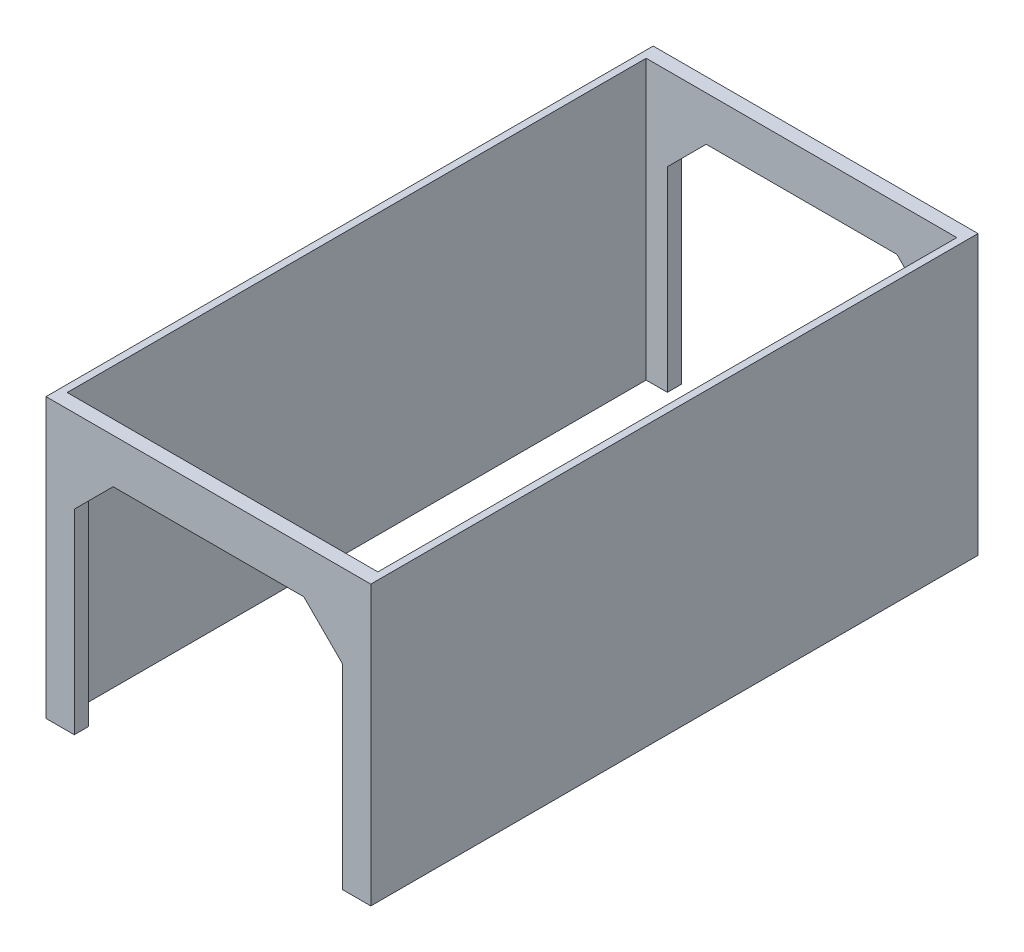
ISO-10303-21;
HEADER;
FILE_DESCRIPTION(('STEP AP214'),'2;1');
FILE_NAME('part.step','',(''),(''),'','','');
FILE_SCHEMA(('AUTOMOTIVE_DESIGN { 1 0 10303 214 1 1 1 1 }'));
ENDSEC;
DATA;
#1=APPLICATION_CONTEXT('core data for automotive mechanical design processes');
#2=APPLICATION_PROTOCOL_DEFINITION('international standard','automotive_design',2000,#1);
#3=PRODUCT_CONTEXT('',#1,'mechanical');
#4=PRODUCT('Part','Part','',(#3));
#5=PRODUCT_RELATED_PRODUCT_CATEGORY('part','',(#4));
#6=PRODUCT_DEFINITION_FORMATION('','',#4);
#7=PRODUCT_DEFINITION_CONTEXT('part definition',#1,'design');
#8=PRODUCT_DEFINITION('design','',#6,#7);
#9=PRODUCT_DEFINITION_SHAPE('','',#8);
#10=(LENGTH_UNIT() NAMED_UNIT(*) SI_UNIT(.MILLI.,.METRE.));
#11=(NAMED_UNIT(*) PLANE_ANGLE_UNIT() SI_UNIT($,.RADIAN.));
#12=(NAMED_UNIT(*) SI_UNIT($,.STERADIAN.) SOLID_ANGLE_UNIT());
#13=UNCERTAINTY_MEASURE_WITH_UNIT(LENGTH_MEASURE(1.E-05),#10,'distance_accuracy_value','');
#14=(GEOMETRIC_REPRESENTATION_CONTEXT(3) GLOBAL_UNCERTAINTY_ASSIGNED_CONTEXT((#13)) GLOBAL_UNIT_ASSIGNED_CONTEXT((#10,
#11,#12)) REPRESENTATION_CONTEXT('',''));
#15=CARTESIAN_POINT('',(0.,0.,0.));
#16=DIRECTION('',(0.,0.,1.));
#17=DIRECTION('',(1.,0.,0.));
#18=AXIS2_PLACEMENT_3D('',#15,#16,#17);
#19=CARTESIAN_POINT('',(5.00000000000011,-308.,420.));
#20=DIRECTION('',(0.,0.,1.));
#21=DIRECTION('',(1.,0.,0.));
#22=AXIS2_PLACEMENT_3D('',#19,#20,#21);
#23=PLANE('',#22);
#24=DIRECTION('',(0.,1.,0.));
#25=VECTOR('',#24,1.);
#26=CARTESIAN_POINT('',(225.,-308.,420.));
#27=LINE('',#26,#25);
#28=CARTESIAN_POINT('',(225.,-75.4,420.));
#29=VERTEX_POINT('',#28);
#30=CARTESIAN_POINT('',(225.,122.,420.));
#31=VERTEX_POINT('',#30);
#32=EDGE_CURVE('E52',#29,#31,#27,.T.);
#33=ORIENTED_EDGE('',*,*,#32,.F.);
#34=DIRECTION('',(1.,0.,0.));
#35=VECTOR('',#34,1.);
#36=CARTESIAN_POINT('',(0.,-75.4,420.));
#37=LINE('',#36,#35);
#38=CARTESIAN_POINT('',(210.059094728396,-75.4,420.));
#39=VERTEX_POINT('',#38);
#40=EDGE_CURVE('E307',#39,#29,#37,.T.);
#41=ORIENTED_EDGE('',*,*,#40,.F.);
#42=DIRECTION('',(0.,1.,0.));
#43=VECTOR('',#42,1.);
#44=CARTESIAN_POINT('',(210.059094728396,-1.18985940560909E-12,420.));
#45=LINE('',#44,#43);
#46=CARTESIAN_POINT('',(210.059094728396,62.9999784310792,420.));
#47=VERTEX_POINT('',#46);
#48=EDGE_CURVE('E249',#39,#47,#45,.T.);
#49=ORIENTED_EDGE('',*,*,#48,.T.);
#50=DIRECTION('',(-0.707106781186543,0.707106781186552,0.));
#51=VECTOR('',#50,1.);
#52=CARTESIAN_POINT('',(136.529536579739,136.529536579737,420.));
#53=LINE('',#52,#51);
#54=CARTESIAN_POINT('',(182.559073159476,90.4999999999999,420.));
#55=VERTEX_POINT('',#54);
#56=EDGE_CURVE('E252',#47,#55,#53,.T.);
#57=ORIENTED_EDGE('',*,*,#56,.T.);
#58=DIRECTION('',(1.,0.,0.));
#59=VECTOR('',#58,1.);
#60=CARTESIAN_POINT('',(0.,90.5,420.));
#61=LINE('',#60,#59);
#62=CARTESIAN_POINT('',(47.5320051405372,90.5,420.));
#63=VERTEX_POINT('',#62);
#64=EDGE_CURVE('E121',#63,#55,#61,.T.);
#65=ORIENTED_EDGE('',*,*,#64,.F.);
#66=DIRECTION('',(0.707106781186543,0.707106781186552,0.));
#67=VECTOR('',#66,1.);
#68=CARTESIAN_POINT('',(-21.4839974297311,21.4839974297308,420.));
#69=LINE('',#68,#67);
#70=CARTESIAN_POINT('',(20.0319835716168,62.9999784310792,420.));
#71=VERTEX_POINT('',#70);
#72=EDGE_CURVE('E256',#71,#63,#69,.T.);
#73=ORIENTED_EDGE('',*,*,#72,.F.);
#74=DIRECTION('',(0.,-1.,0.));
#75=VECTOR('',#74,1.);
#76=CARTESIAN_POINT('',(20.0319835716168,0.,420.));
#77=LINE('',#76,#75);
#78=CARTESIAN_POINT('',(20.0319835716168,-75.4,420.));
#79=VERTEX_POINT('',#78);
#80=EDGE_CURVE('E141',#71,#79,#77,.T.);
#81=ORIENTED_EDGE('',*,*,#80,.T.);
#82=DIRECTION('',(1.,0.,0.));
#83=VECTOR('',#82,1.);
#84=CARTESIAN_POINT('',(0.,-75.4,420.));
#85=LINE('',#84,#83);
#86=CARTESIAN_POINT('',(5.00000000000004,-75.4,420.));
#87=VERTEX_POINT('',#86);
#88=EDGE_CURVE('E211',#87,#79,#85,.T.);
#89=ORIENTED_EDGE('',*,*,#88,.F.);
#90=DIRECTION('',(0.,1.,0.));
#91=VECTOR('',#90,1.);
#92=CARTESIAN_POINT('',(5.00000000000011,-308.,420.));
#93=LINE('',#92,#91);
#94=CARTESIAN_POINT('',(5.00000000000003,122.,420.));
#95=VERTEX_POINT('',#94);
#96=EDGE_CURVE('E228',#87,#95,#93,.T.);
#97=ORIENTED_EDGE('',*,*,#96,.T.);
#98=DIRECTION('',(1.,0.,0.));
#99=VECTOR('',#98,1.);
#100=CARTESIAN_POINT('',(5.00000000000003,122.,420.));
#101=LINE('',#100,#99);
#102=EDGE_CURVE('E217',#95,#31,#101,.T.);
#103=ORIENTED_EDGE('',*,*,#102,.T.);
#104=EDGE_LOOP('',(#33,#41,#49,#57,#65,#73,#81,#89,#97,#103));
#105=FACE_BOUND('',#104,.T.);
#106=ADVANCED_FACE('F37',(#105),#23,.F.);
#107=CARTESIAN_POINT('',(5.00000000000006,-308.,10.));
#108=DIRECTION('',(0.,0.,1.));
#109=DIRECTION('',(1.,0.,0.));
#110=AXIS2_PLACEMENT_3D('',#107,#108,#109);
#111=PLANE('',#110);
#112=DIRECTION('',(0.,1.,0.));
#113=VECTOR('',#112,1.);
#114=CARTESIAN_POINT('',(210.059094728396,-1.18985940560909E-12,10.));
#115=LINE('',#114,#113);
#116=CARTESIAN_POINT('',(210.059094728396,-75.4,10.));
#117=VERTEX_POINT('',#116);
#118=CARTESIAN_POINT('',(210.059094728396,62.9999784310792,10.));
#119=VERTEX_POINT('',#118);
#120=EDGE_CURVE('E231',#117,#119,#115,.T.);
#121=ORIENTED_EDGE('',*,*,#120,.F.);
#122=DIRECTION('',(-1.,0.,0.));
#123=VECTOR('',#122,1.);
#124=CARTESIAN_POINT('',(0.,-75.4,10.));
#125=LINE('',#124,#123);
#126=CARTESIAN_POINT('',(225.,-75.4,10.));
#127=VERTEX_POINT('',#126);
#128=EDGE_CURVE('E301',#127,#117,#125,.T.);
#129=ORIENTED_EDGE('',*,*,#128,.F.);
#130=DIRECTION('',(0.,1.,0.));
#131=VECTOR('',#130,1.);
#132=CARTESIAN_POINT('',(225.,-308.,10.));
#133=LINE('',#132,#131);
#134=CARTESIAN_POINT('',(225.,122.,10.));
#135=VERTEX_POINT('',#134);
#136=EDGE_CURVE('E235',#127,#135,#133,.T.);
#137=ORIENTED_EDGE('',*,*,#136,.T.);
#138=DIRECTION('',(1.,0.,0.));
#139=VECTOR('',#138,1.);
#140=CARTESIAN_POINT('',(4.99999999999998,122.,10.));
#141=LINE('',#140,#139);
#142=CARTESIAN_POINT('',(4.99999999999998,122.,10.));
#143=VERTEX_POINT('',#142);
#144=EDGE_CURVE('E222',#143,#135,#141,.T.);
#145=ORIENTED_EDGE('',*,*,#144,.F.);
#146=DIRECTION('',(0.,1.,0.));
#147=VECTOR('',#146,1.);
#148=CARTESIAN_POINT('',(5.00000000000006,-308.,10.));
#149=LINE('',#148,#147);
#150=CARTESIAN_POINT('',(5.00000000000001,-75.4,10.));
#151=VERTEX_POINT('',#150);
#152=EDGE_CURVE('E232',#151,#143,#149,.T.);
#153=ORIENTED_EDGE('',*,*,#152,.F.);
#154=DIRECTION('',(1.,0.,0.));
#155=VECTOR('',#154,1.);
#156=CARTESIAN_POINT('',(0.,-75.4,10.));
#157=LINE('',#156,#155);
#158=CARTESIAN_POINT('',(20.0319835716168,-75.4,10.));
#159=VERTEX_POINT('',#158);
#160=EDGE_CURVE('E200',#151,#159,#157,.T.);
#161=ORIENTED_EDGE('',*,*,#160,.T.);
#162=DIRECTION('',(0.,-1.,0.));
#163=VECTOR('',#162,1.);
#164=CARTESIAN_POINT('',(20.0319835716168,0.,10.));
#165=LINE('',#164,#163);
#166=CARTESIAN_POINT('',(20.0319835716168,62.9999784310792,10.));
#167=VERTEX_POINT('',#166);
#168=EDGE_CURVE('E194',#167,#159,#165,.T.);
#169=ORIENTED_EDGE('',*,*,#168,.F.);
#170=DIRECTION('',(0.707106781186543,0.707106781186552,0.));
#171=VECTOR('',#170,1.);
#172=CARTESIAN_POINT('',(-21.4839974297311,21.4839974297308,10.));
#173=LINE('',#172,#171);
#174=CARTESIAN_POINT('',(47.5320051405372,90.5,10.));
#175=VERTEX_POINT('',#174);
#176=EDGE_CURVE('E179',#167,#175,#173,.T.);
#177=ORIENTED_EDGE('',*,*,#176,.T.);
#178=DIRECTION('',(1.,0.,0.));
#179=VECTOR('',#178,1.);
#180=CARTESIAN_POINT('',(0.,90.5,10.));
#181=LINE('',#180,#179);
#182=CARTESIAN_POINT('',(182.559073159476,90.4999999999999,10.));
#183=VERTEX_POINT('',#182);
#184=EDGE_CURVE('E244',#175,#183,#181,.T.);
#185=ORIENTED_EDGE('',*,*,#184,.T.);
#186=DIRECTION('',(-0.707106781186543,0.707106781186552,0.));
#187=VECTOR('',#186,1.);
#188=CARTESIAN_POINT('',(136.529536579739,136.529536579737,10.));
#189=LINE('',#188,#187);
#190=EDGE_CURVE('E241',#119,#183,#189,.T.);
#191=ORIENTED_EDGE('',*,*,#190,.F.);
#192=EDGE_LOOP('',(#121,#129,#137,#145,#153,#161,#169,#177,#185,#191));
#193=FACE_BOUND('',#192,.T.);
#194=ADVANCED_FACE('F366',(#193),#111,.T.);
#195=CARTESIAN_POINT('',(0.,0.,430.));
#196=DIRECTION('',(0.,0.,1.));
#197=DIRECTION('',(1.,0.,0.));
#198=AXIS2_PLACEMENT_3D('',#195,#196,#197);
#199=PLANE('',#198);
#200=DIRECTION('',(0.,1.,0.));
#201=VECTOR('',#200,1.);
#202=CARTESIAN_POINT('',(210.059094728396,-1.18985940560909E-12,430.));
#203=LINE('',#202,#201);
#204=CARTESIAN_POINT('',(210.059094728396,-75.4,430.));
#205=VERTEX_POINT('',#204);
#206=CARTESIAN_POINT('',(210.059094728396,62.9999784310792,430.));
#207=VERTEX_POINT('',#206);
#208=EDGE_CURVE('E131',#205,#207,#203,.T.);
#209=ORIENTED_EDGE('',*,*,#208,.F.);
#210=DIRECTION('',(-1.,0.,0.));
#211=VECTOR('',#210,1.);
#212=CARTESIAN_POINT('',(0.,-75.4,430.));
#213=LINE('',#212,#211);
#214=CARTESIAN_POINT('',(230.,-75.4,430.));
#215=VERTEX_POINT('',#214);
#216=EDGE_CURVE('E287',#215,#205,#213,.T.);
#217=ORIENTED_EDGE('',*,*,#216,.F.);
#218=DIRECTION('',(0.,-1.,0.));
#219=VECTOR('',#218,1.);
#220=CARTESIAN_POINT('',(230.,0.,430.));
#221=LINE('',#220,#219);
#222=CARTESIAN_POINT('',(230.,122.,430.));
#223=VERTEX_POINT('',#222);
#224=EDGE_CURVE('E133',#223,#215,#221,.T.);
#225=ORIENTED_EDGE('',*,*,#224,.F.);
#226=DIRECTION('',(1.,0.,0.));
#227=VECTOR('',#226,1.);
#228=CARTESIAN_POINT('',(0.,122.,430.));
#229=LINE('',#228,#227);
#230=CARTESIAN_POINT('',(0.,122.,430.));
#231=VERTEX_POINT('',#230);
#232=EDGE_CURVE('E161',#231,#223,#229,.T.);
#233=ORIENTED_EDGE('',*,*,#232,.F.);
#234=DIRECTION('',(0.,-1.,0.));
#235=VECTOR('',#234,1.);
#236=CARTESIAN_POINT('',(0.,0.,430.));
#237=LINE('',#236,#235);
#238=CARTESIAN_POINT('',(0.,-75.4,430.));
#239=VERTEX_POINT('',#238);
#240=EDGE_CURVE('E261',#231,#239,#237,.T.);
#241=ORIENTED_EDGE('',*,*,#240,.T.);
#242=DIRECTION('',(-1.,0.,0.));
#243=VECTOR('',#242,1.);
#244=CARTESIAN_POINT('',(0.,-75.4,430.));
#245=LINE('',#244,#243);
#246=CARTESIAN_POINT('',(20.0319835716168,-75.4,430.));
#247=VERTEX_POINT('',#246);
#248=EDGE_CURVE('E279',#247,#239,#245,.T.);
#249=ORIENTED_EDGE('',*,*,#248,.F.);
#250=DIRECTION('',(0.,-1.,0.));
#251=VECTOR('',#250,1.);
#252=CARTESIAN_POINT('',(20.0319835716168,0.,430.));
#253=LINE('',#252,#251);
#254=CARTESIAN_POINT('',(20.0319835716168,62.9999784310792,430.));
#255=VERTEX_POINT('',#254);
#256=EDGE_CURVE('E264',#255,#247,#253,.T.);
#257=ORIENTED_EDGE('',*,*,#256,.F.);
#258=DIRECTION('',(0.707106781186543,0.707106781186552,0.));
#259=VECTOR('',#258,1.);
#260=CARTESIAN_POINT('',(-21.4839974297311,21.4839974297308,430.));
#261=LINE('',#260,#259);
#262=CARTESIAN_POINT('',(47.5320051405372,90.5,430.));
#263=VERTEX_POINT('',#262);
#264=EDGE_CURVE('E110',#255,#263,#261,.T.);
#265=ORIENTED_EDGE('',*,*,#264,.T.);
#266=DIRECTION('',(1.,0.,0.));
#267=VECTOR('',#266,1.);
#268=CARTESIAN_POINT('',(0.,90.5,430.));
#269=LINE('',#268,#267);
#270=CARTESIAN_POINT('',(182.559073159476,90.5,430.));
#271=VERTEX_POINT('',#270);
#272=EDGE_CURVE('E102',#263,#271,#269,.T.);
#273=ORIENTED_EDGE('',*,*,#272,.T.);
#274=DIRECTION('',(-0.707106781186544,0.707106781186552,0.));
#275=VECTOR('',#274,1.);
#276=CARTESIAN_POINT('',(136.529536579739,136.529536579737,430.));
#277=LINE('',#276,#275);
#278=EDGE_CURVE('E107',#207,#271,#277,.T.);
#279=ORIENTED_EDGE('',*,*,#278,.F.);
#280=EDGE_LOOP('',(#209,#217,#225,#233,#241,#249,#257,#265,#273,#279));
#281=FACE_BOUND('',#280,.T.);
#282=ADVANCED_FACE('F105',(#281),#199,.T.);
#283=CARTESIAN_POINT('',(0.,0.,0.));
#284=DIRECTION('',(0.,0.,1.));
#285=DIRECTION('',(1.,0.,0.));
#286=AXIS2_PLACEMENT_3D('',#283,#284,#285);
#287=PLANE('',#286);
#288=DIRECTION('',(0.,-1.,0.));
#289=VECTOR('',#288,1.);
#290=CARTESIAN_POINT('',(230.,0.,0.));
#291=LINE('',#290,#289);
#292=CARTESIAN_POINT('',(230.,122.,0.));
#293=VERTEX_POINT('',#292);
#294=CARTESIAN_POINT('',(230.,-75.4,0.));
#295=VERTEX_POINT('',#294);
#296=EDGE_CURVE('E158',#293,#295,#291,.T.);
#297=ORIENTED_EDGE('',*,*,#296,.T.);
#298=DIRECTION('',(1.,0.,0.));
#299=VECTOR('',#298,1.);
#300=CARTESIAN_POINT('',(0.,-75.4,0.));
#301=LINE('',#300,#299);
#302=CARTESIAN_POINT('',(210.059094728396,-75.4,0.));
#303=VERTEX_POINT('',#302);
#304=EDGE_CURVE('E295',#303,#295,#301,.T.);
#305=ORIENTED_EDGE('',*,*,#304,.F.);
#306=DIRECTION('',(0.,1.,0.));
#307=VECTOR('',#306,1.);
#308=CARTESIAN_POINT('',(210.059094728396,-1.18985940560909E-12,0.));
#309=LINE('',#308,#307);
#310=CARTESIAN_POINT('',(210.059094728396,62.9999784310792,0.));
#311=VERTEX_POINT('',#310);
#312=EDGE_CURVE('E156',#303,#311,#309,.T.);
#313=ORIENTED_EDGE('',*,*,#312,.T.);
#314=DIRECTION('',(-0.707106781186544,0.707106781186552,0.));
#315=VECTOR('',#314,1.);
#316=CARTESIAN_POINT('',(136.529536579739,136.529536579737,0.));
#317=LINE('',#316,#315);
#318=CARTESIAN_POINT('',(182.559073159476,90.5,0.));
#319=VERTEX_POINT('',#318);
#320=EDGE_CURVE('E153',#311,#319,#317,.T.);
#321=ORIENTED_EDGE('',*,*,#320,.T.);
#322=DIRECTION('',(1.,0.,0.));
#323=VECTOR('',#322,1.);
#324=CARTESIAN_POINT('',(0.,90.5,0.));
#325=LINE('',#324,#323);
#326=CARTESIAN_POINT('',(47.5320051405372,90.5,0.));
#327=VERTEX_POINT('',#326);
#328=EDGE_CURVE('E150',#327,#319,#325,.T.);
#329=ORIENTED_EDGE('',*,*,#328,.F.);
#330=DIRECTION('',(0.707106781186543,0.707106781186552,0.));
#331=VECTOR('',#330,1.);
#332=CARTESIAN_POINT('',(-21.4839974297311,21.4839974297308,0.));
#333=LINE('',#332,#331);
#334=CARTESIAN_POINT('',(20.0319835716168,62.9999784310792,0.));
#335=VERTEX_POINT('',#334);
#336=EDGE_CURVE('E147',#335,#327,#333,.T.);
#337=ORIENTED_EDGE('',*,*,#336,.F.);
#338=DIRECTION('',(0.,-1.,0.));
#339=VECTOR('',#338,1.);
#340=CARTESIAN_POINT('',(20.0319835716168,0.,0.));
#341=LINE('',#340,#339);
#342=CARTESIAN_POINT('',(20.0319835716168,-75.4,0.));
#343=VERTEX_POINT('',#342);
#344=EDGE_CURVE('E144',#335,#343,#341,.T.);
#345=ORIENTED_EDGE('',*,*,#344,.T.);
#346=DIRECTION('',(1.,0.,0.));
#347=VECTOR('',#346,1.);
#348=CARTESIAN_POINT('',(0.,-75.4,0.));
#349=LINE('',#348,#347);
#350=CARTESIAN_POINT('',(0.,-75.4,0.));
#351=VERTEX_POINT('',#350);
#352=EDGE_CURVE('E201',#351,#343,#349,.T.);
#353=ORIENTED_EDGE('',*,*,#352,.F.);
#354=DIRECTION('',(0.,-1.,0.));
#355=VECTOR('',#354,1.);
#356=CARTESIAN_POINT('',(0.,0.,0.));
#357=LINE('',#356,#355);
#358=CARTESIAN_POINT('',(0.,122.,0.));
#359=VERTEX_POINT('',#358);
#360=EDGE_CURVE('E140',#359,#351,#357,.T.);
#361=ORIENTED_EDGE('',*,*,#360,.F.);
#362=DIRECTION('',(1.,0.,0.));
#363=VECTOR('',#362,1.);
#364=CARTESIAN_POINT('',(0.,122.,0.));
#365=LINE('',#364,#363);
#366=EDGE_CURVE('E138',#359,#293,#365,.T.);
#367=ORIENTED_EDGE('',*,*,#366,.T.);
#368=EDGE_LOOP('',(#297,#305,#313,#321,#329,#337,#345,#353,#361,#367));
#369=FACE_BOUND('',#368,.T.);
#370=ADVANCED_FACE('F184',(#369),#287,.F.);
#371=CARTESIAN_POINT('',(20.0319835716168,0.,430.));
#372=DIRECTION('',(1.,0.,0.));
#373=DIRECTION('',(0.,1.,0.));
#374=AXIS2_PLACEMENT_3D('',#371,#372,#373);
#375=PLANE('',#374);
#376=ORIENTED_EDGE('',*,*,#168,.T.);
#377=DIRECTION('',(0.,0.,1.));
#378=VECTOR('',#377,1.);
#379=CARTESIAN_POINT('',(20.0319835716168,-75.4,0.));
#380=LINE('',#379,#378);
#381=EDGE_CURVE('E191',#343,#159,#380,.T.);
#382=ORIENTED_EDGE('',*,*,#381,.F.);
#383=ORIENTED_EDGE('',*,*,#344,.F.);
#384=DIRECTION('',(0.,0.,-1.));
#385=VECTOR('',#384,1.);
#386=CARTESIAN_POINT('',(20.0319835716168,62.9999784310792,430.));
#387=LINE('',#386,#385);
#388=EDGE_CURVE('E166',#167,#335,#387,.T.);
#389=ORIENTED_EDGE('',*,*,#388,.F.);
#390=EDGE_LOOP('',(#376,#382,#383,#389));
#391=FACE_BOUND('',#390,.T.);
#392=ADVANCED_FACE('F189',(#391),#375,.T.);
#393=CARTESIAN_POINT('',(-21.4839974297311,21.4839974297308,430.));
#394=DIRECTION('',(-0.707106781186552,0.707106781186543,0.));
#395=DIRECTION('',(-0.707106781186543,-0.707106781186552,0.));
#396=AXIS2_PLACEMENT_3D('',#393,#394,#395);
#397=PLANE('',#396);
#398=ORIENTED_EDGE('',*,*,#176,.F.);
#399=ORIENTED_EDGE('',*,*,#388,.T.);
#400=ORIENTED_EDGE('',*,*,#336,.T.);
#401=DIRECTION('',(0.,0.,-1.));
#402=VECTOR('',#401,1.);
#403=CARTESIAN_POINT('',(47.5320051405372,90.5,430.));
#404=LINE('',#403,#402);
#405=EDGE_CURVE('E124',#175,#327,#404,.T.);
#406=ORIENTED_EDGE('',*,*,#405,.F.);
#407=EDGE_LOOP('',(#398,#399,#400,#406));
#408=FACE_BOUND('',#407,.T.);
#409=ADVANCED_FACE('F174',(#408),#397,.F.);
#410=CARTESIAN_POINT('',(0.,90.5,430.));
#411=DIRECTION('',(0.,1.,0.));
#412=DIRECTION('',(0.,0.,1.));
#413=AXIS2_PLACEMENT_3D('',#410,#411,#412);
#414=PLANE('',#413);
#415=ORIENTED_EDGE('',*,*,#184,.F.);
#416=ORIENTED_EDGE('',*,*,#405,.T.);
#417=ORIENTED_EDGE('',*,*,#328,.T.);
#418=DIRECTION('',(0.,0.,-1.));
#419=VECTOR('',#418,1.);
#420=CARTESIAN_POINT('',(182.559073159476,90.5,430.));
#421=LINE('',#420,#419);
#422=EDGE_CURVE('E125',#183,#319,#421,.T.);
#423=ORIENTED_EDGE('',*,*,#422,.F.);
#424=EDGE_LOOP('',(#415,#416,#417,#423));
#425=FACE_BOUND('',#424,.T.);
#426=ADVANCED_FACE('F361',(#425),#414,.F.);
#427=CARTESIAN_POINT('',(136.529536579739,136.529536579737,430.));
#428=DIRECTION('',(-0.707106781186552,-0.707106781186543,0.));
#429=DIRECTION('',(0.707106781186543,-0.707106781186552,0.));
#430=AXIS2_PLACEMENT_3D('',#427,#428,#429);
#431=PLANE('',#430);
#432=DIRECTION('',(0.,0.,-1.));
#433=VECTOR('',#432,1.);
#434=CARTESIAN_POINT('',(210.059094728396,62.9999784310792,430.));
#435=LINE('',#434,#433);
#436=EDGE_CURVE('E163',#119,#311,#435,.T.);
#437=ORIENTED_EDGE('',*,*,#436,.F.);
#438=ORIENTED_EDGE('',*,*,#190,.T.);
#439=ORIENTED_EDGE('',*,*,#422,.T.);
#440=ORIENTED_EDGE('',*,*,#320,.F.);
#441=EDGE_LOOP('',(#437,#438,#439,#440));
#442=FACE_BOUND('',#441,.T.);
#443=ADVANCED_FACE('F389',(#442),#431,.T.);
#444=CARTESIAN_POINT('',(210.059094728396,-1.18985940560909E-12,430.));
#445=DIRECTION('',(-1.,0.,0.));
#446=DIRECTION('',(0.,-1.,0.));
#447=AXIS2_PLACEMENT_3D('',#444,#445,#446);
#448=PLANE('',#447);
#449=ORIENTED_EDGE('',*,*,#312,.F.);
#450=DIRECTION('',(0.,0.,-1.));
#451=VECTOR('',#450,1.);
#452=CARTESIAN_POINT('',(210.059094728396,-75.4,0.));
#453=LINE('',#452,#451);
#454=EDGE_CURVE('E298',#117,#303,#453,.T.);
#455=ORIENTED_EDGE('',*,*,#454,.F.);
#456=ORIENTED_EDGE('',*,*,#120,.T.);
#457=ORIENTED_EDGE('',*,*,#436,.T.);
#458=EDGE_LOOP('',(#449,#455,#456,#457));
#459=FACE_BOUND('',#458,.T.);
#460=ADVANCED_FACE('F387',(#459),#448,.T.);
#461=CARTESIAN_POINT('',(0.,122.,430.));
#462=DIRECTION('',(0.,1.,0.));
#463=DIRECTION('',(-1.,0.,0.));
#464=AXIS2_PLACEMENT_3D('',#461,#462,#463);
#465=PLANE('',#464);
#466=ORIENTED_EDGE('',*,*,#102,.F.);
#467=DIRECTION('',(0.,0.,1.));
#468=VECTOR('',#467,1.);
#469=CARTESIAN_POINT('',(4.99999999999998,122.,10.));
#470=LINE('',#469,#468);
#471=EDGE_CURVE('E225',#143,#95,#470,.T.);
#472=ORIENTED_EDGE('',*,*,#471,.F.);
#473=ORIENTED_EDGE('',*,*,#144,.T.);
#474=DIRECTION('',(0.,0.,1.));
#475=VECTOR('',#474,1.);
#476=CARTESIAN_POINT('',(225.,122.,10.));
#477=LINE('',#476,#475);
#478=EDGE_CURVE('E219',#135,#31,#477,.T.);
#479=ORIENTED_EDGE('',*,*,#478,.T.);
#480=EDGE_LOOP('',(#466,#472,#473,#479));
#481=FACE_BOUND('',#480,.T.);
#482=ORIENTED_EDGE('',*,*,#366,.F.);
#483=DIRECTION('',(0.,0.,-1.));
#484=VECTOR('',#483,1.);
#485=CARTESIAN_POINT('',(0.,122.,430.));
#486=LINE('',#485,#484);
#487=EDGE_CURVE('E11',#231,#359,#486,.T.);
#488=ORIENTED_EDGE('',*,*,#487,.F.);
#489=ORIENTED_EDGE('',*,*,#232,.T.);
#490=DIRECTION('',(0.,0.,-1.));
#491=VECTOR('',#490,1.);
#492=CARTESIAN_POINT('',(230.,122.,430.));
#493=LINE('',#492,#491);
#494=EDGE_CURVE('E61',#223,#293,#493,.T.);
#495=ORIENTED_EDGE('',*,*,#494,.T.);
#496=EDGE_LOOP('',(#482,#488,#489,#495));
#497=FACE_BOUND('',#496,.T.);
#498=ADVANCED_FACE('F39',(#481,#497),#465,.T.);
#499=CARTESIAN_POINT('',(0.,0.,430.));
#500=DIRECTION('',(1.,0.,0.));
#501=DIRECTION('',(0.,1.,0.));
#502=AXIS2_PLACEMENT_3D('',#499,#500,#501);
#503=PLANE('',#502);
#504=ORIENTED_EDGE('',*,*,#360,.T.);
#505=DIRECTION('',(0.,0.,-1.));
#506=VECTOR('',#505,1.);
#507=CARTESIAN_POINT('',(0.,-75.4,0.));
#508=LINE('',#507,#506);
#509=EDGE_CURVE('E205',#239,#351,#508,.T.);
#510=ORIENTED_EDGE('',*,*,#509,.F.);
#511=ORIENTED_EDGE('',*,*,#240,.F.);
#512=ORIENTED_EDGE('',*,*,#487,.T.);
#513=EDGE_LOOP('',(#504,#510,#511,#512));
#514=FACE_BOUND('',#513,.T.);
#515=ADVANCED_FACE('F362',(#514),#503,.F.);
#516=ORIENTED_EDGE('',*,*,#256,.T.);
#517=DIRECTION('',(0.,0.,1.));
#518=VECTOR('',#517,1.);
#519=CARTESIAN_POINT('',(20.0319835716168,-75.4,0.));
#520=LINE('',#519,#518);
#521=EDGE_CURVE('E214',#79,#247,#520,.T.);
#522=ORIENTED_EDGE('',*,*,#521,.F.);
#523=ORIENTED_EDGE('',*,*,#80,.F.);
#524=EDGE_CURVE('E45',#255,#71,#387,.T.);
#525=ORIENTED_EDGE('',*,*,#524,.F.);
#526=EDGE_LOOP('',(#516,#522,#523,#525));
#527=FACE_BOUND('',#526,.T.);
#528=ADVANCED_FACE('F269',(#527),#375,.T.);
#529=ORIENTED_EDGE('',*,*,#524,.T.);
#530=ORIENTED_EDGE('',*,*,#72,.T.);
#531=EDGE_CURVE('E165',#263,#63,#404,.T.);
#532=ORIENTED_EDGE('',*,*,#531,.F.);
#533=ORIENTED_EDGE('',*,*,#264,.F.);
#534=EDGE_LOOP('',(#529,#530,#532,#533));
#535=FACE_BOUND('',#534,.T.);
#536=ADVANCED_FACE('F353',(#535),#397,.F.);
#537=ORIENTED_EDGE('',*,*,#531,.T.);
#538=ORIENTED_EDGE('',*,*,#64,.T.);
#539=EDGE_CURVE('E117',#271,#55,#421,.T.);
#540=ORIENTED_EDGE('',*,*,#539,.F.);
#541=ORIENTED_EDGE('',*,*,#272,.F.);
#542=EDGE_LOOP('',(#537,#538,#540,#541));
#543=FACE_BOUND('',#542,.T.);
#544=ADVANCED_FACE('F118',(#543),#414,.F.);
#545=ORIENTED_EDGE('',*,*,#56,.F.);
#546=EDGE_CURVE('E130',#207,#47,#435,.T.);
#547=ORIENTED_EDGE('',*,*,#546,.F.);
#548=ORIENTED_EDGE('',*,*,#278,.T.);
#549=ORIENTED_EDGE('',*,*,#539,.T.);
#550=EDGE_LOOP('',(#545,#547,#548,#549));
#551=FACE_BOUND('',#550,.T.);
#552=ADVANCED_FACE('F128',(#551),#431,.T.);
#553=ORIENTED_EDGE('',*,*,#48,.F.);
#554=DIRECTION('',(0.,0.,-1.));
#555=VECTOR('',#554,1.);
#556=CARTESIAN_POINT('',(210.059094728396,-75.4,0.));
#557=LINE('',#556,#555);
#558=EDGE_CURVE('E284',#205,#39,#557,.T.);
#559=ORIENTED_EDGE('',*,*,#558,.F.);
#560=ORIENTED_EDGE('',*,*,#208,.T.);
#561=ORIENTED_EDGE('',*,*,#546,.T.);
#562=EDGE_LOOP('',(#553,#559,#560,#561));
#563=FACE_BOUND('',#562,.T.);
#564=ADVANCED_FACE('F384',(#563),#448,.T.);
#565=CARTESIAN_POINT('',(230.,0.,430.));
#566=DIRECTION('',(1.,0.,0.));
#567=DIRECTION('',(0.,1.,0.));
#568=AXIS2_PLACEMENT_3D('',#565,#566,#567);
#569=PLANE('',#568);
#570=ORIENTED_EDGE('',*,*,#224,.T.);
#571=DIRECTION('',(0.,0.,1.));
#572=VECTOR('',#571,1.);
#573=CARTESIAN_POINT('',(230.,-75.4,0.));
#574=LINE('',#573,#572);
#575=EDGE_CURVE('E292',#295,#215,#574,.T.);
#576=ORIENTED_EDGE('',*,*,#575,.F.);
#577=ORIENTED_EDGE('',*,*,#296,.F.);
#578=ORIENTED_EDGE('',*,*,#494,.F.);
#579=EDGE_LOOP('',(#570,#576,#577,#578));
#580=FACE_BOUND('',#579,.T.);
#581=ADVANCED_FACE('F380',(#580),#569,.T.);
#582=CARTESIAN_POINT('',(5.00000000000006,-308.,10.));
#583=DIRECTION('',(-1.,0.,0.));
#584=DIRECTION('',(0.,-1.,0.));
#585=AXIS2_PLACEMENT_3D('',#582,#583,#584);
#586=PLANE('',#585);
#587=ORIENTED_EDGE('',*,*,#96,.F.);
#588=DIRECTION('',(0.,0.,-1.));
#589=VECTOR('',#588,1.);
#590=CARTESIAN_POINT('',(5.00000000000001,-75.4,0.));
#591=LINE('',#590,#589);
#592=EDGE_CURVE('E203',#87,#151,#591,.T.);
#593=ORIENTED_EDGE('',*,*,#592,.T.);
#594=ORIENTED_EDGE('',*,*,#152,.T.);
#595=ORIENTED_EDGE('',*,*,#471,.T.);
#596=EDGE_LOOP('',(#587,#593,#594,#595));
#597=FACE_BOUND('',#596,.T.);
#598=ADVANCED_FACE('F383',(#597),#586,.F.);
#599=CARTESIAN_POINT('',(225.,-308.,10.));
#600=DIRECTION('',(-1.,0.,0.));
#601=DIRECTION('',(0.,-1.,0.));
#602=AXIS2_PLACEMENT_3D('',#599,#600,#601);
#603=PLANE('',#602);
#604=ORIENTED_EDGE('',*,*,#136,.F.);
#605=DIRECTION('',(0.,0.,-1.));
#606=VECTOR('',#605,1.);
#607=CARTESIAN_POINT('',(225.,-75.4,0.));
#608=LINE('',#607,#606);
#609=EDGE_CURVE('E304',#29,#127,#608,.T.);
#610=ORIENTED_EDGE('',*,*,#609,.F.);
#611=ORIENTED_EDGE('',*,*,#32,.T.);
#612=ORIENTED_EDGE('',*,*,#478,.F.);
#613=EDGE_LOOP('',(#604,#610,#611,#612));
#614=FACE_BOUND('',#613,.T.);
#615=ADVANCED_FACE('F375',(#614),#603,.T.);
#616=CARTESIAN_POINT('',(0.,-75.4,0.));
#617=DIRECTION('',(0.,-1.,0.));
#618=DIRECTION('',(0.,0.,-1.));
#619=AXIS2_PLACEMENT_3D('',#616,#617,#618);
#620=PLANE('',#619);
#621=ORIENTED_EDGE('',*,*,#248,.T.);
#622=ORIENTED_EDGE('',*,*,#509,.T.);
#623=ORIENTED_EDGE('',*,*,#352,.T.);
#624=ORIENTED_EDGE('',*,*,#381,.T.);
#625=ORIENTED_EDGE('',*,*,#160,.F.);
#626=ORIENTED_EDGE('',*,*,#592,.F.);
#627=ORIENTED_EDGE('',*,*,#88,.T.);
#628=ORIENTED_EDGE('',*,*,#521,.T.);
#629=EDGE_LOOP('',(#621,#622,#623,#624,#625,#626,#627,#628));
#630=FACE_BOUND('',#629,.T.);
#631=ADVANCED_FACE('F276',(#630),#620,.T.);
#632=CARTESIAN_POINT('',(0.,-75.4,0.));
#633=DIRECTION('',(0.,-1.,0.));
#634=DIRECTION('',(0.,0.,-1.));
#635=AXIS2_PLACEMENT_3D('',#632,#633,#634);
#636=PLANE('',#635);
#637=ORIENTED_EDGE('',*,*,#40,.T.);
#638=ORIENTED_EDGE('',*,*,#609,.T.);
#639=ORIENTED_EDGE('',*,*,#128,.T.);
#640=ORIENTED_EDGE('',*,*,#454,.T.);
#641=ORIENTED_EDGE('',*,*,#304,.T.);
#642=ORIENTED_EDGE('',*,*,#575,.T.);
#643=ORIENTED_EDGE('',*,*,#216,.T.);
#644=ORIENTED_EDGE('',*,*,#558,.T.);
#645=EDGE_LOOP('',(#637,#638,#639,#640,#641,#642,#643,#644));
#646=FACE_BOUND('',#645,.T.);
#647=ADVANCED_FACE('F312',(#646),#636,.T.);
#648=CLOSED_SHELL('',(#106,#194,#282,#370,#392,#409,#426,#443,#460,#498,#515,#528,#536,#544,
#552,#564,#581,#598,#615,#631,#647));
#649=MANIFOLD_SOLID_BREP('B2',#648);
#650=ADVANCED_BREP_SHAPE_REPRESENTATION('',(#18,#649),#14);
#651=SHAPE_DEFINITION_REPRESENTATION(#9,#650);
ENDSEC;
END-ISO-10303-21;
